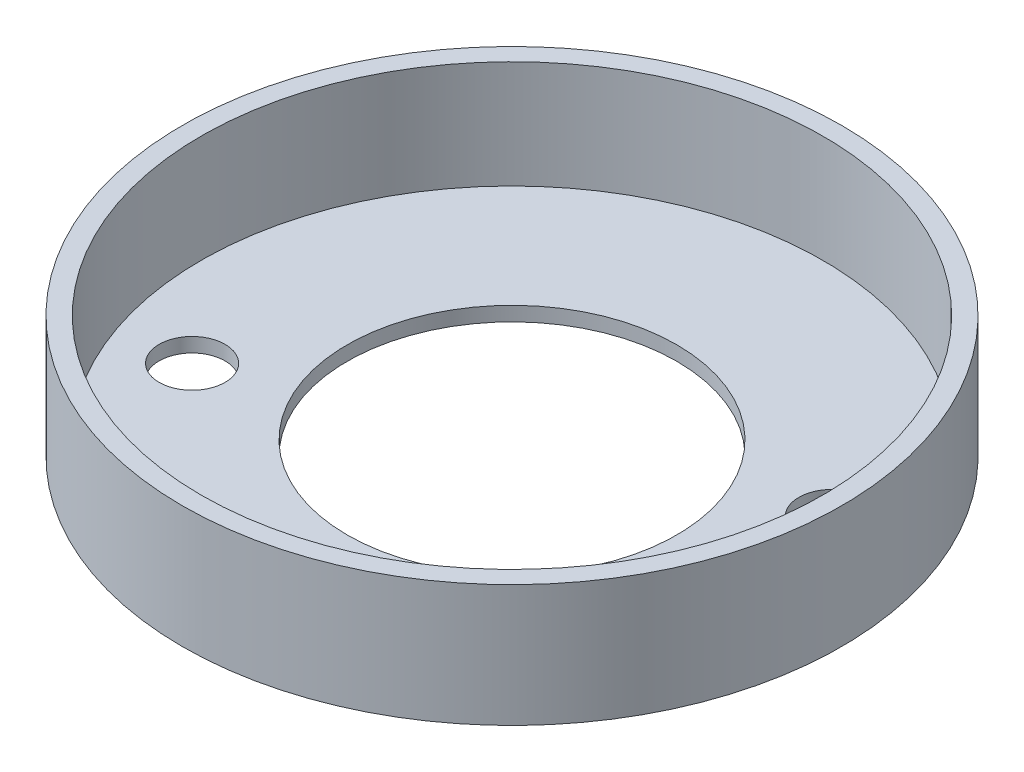
ISO-10303-21;
HEADER;
FILE_DESCRIPTION(('STEP AP214'),'2;1');
FILE_NAME('part.step','',(''),(''),'','','');
FILE_SCHEMA(('AUTOMOTIVE_DESIGN { 1 0 10303 214 1 1 1 1 }'));
ENDSEC;
DATA;
#1=APPLICATION_CONTEXT('core data for automotive mechanical design processes');
#2=APPLICATION_PROTOCOL_DEFINITION('international standard','automotive_design',2000,#1);
#3=PRODUCT_CONTEXT('',#1,'mechanical');
#4=PRODUCT('Part','Part','',(#3));
#5=PRODUCT_RELATED_PRODUCT_CATEGORY('part','',(#4));
#6=PRODUCT_DEFINITION_FORMATION('','',#4);
#7=PRODUCT_DEFINITION_CONTEXT('part definition',#1,'design');
#8=PRODUCT_DEFINITION('design','',#6,#7);
#9=PRODUCT_DEFINITION_SHAPE('','',#8);
#10=(LENGTH_UNIT() NAMED_UNIT(*) SI_UNIT(.MILLI.,.METRE.));
#11=(NAMED_UNIT(*) PLANE_ANGLE_UNIT() SI_UNIT($,.RADIAN.));
#12=(NAMED_UNIT(*) SI_UNIT($,.STERADIAN.) SOLID_ANGLE_UNIT());
#13=UNCERTAINTY_MEASURE_WITH_UNIT(LENGTH_MEASURE(1.E-05),#10,'distance_accuracy_value','');
#14=(GEOMETRIC_REPRESENTATION_CONTEXT(3) GLOBAL_UNCERTAINTY_ASSIGNED_CONTEXT((#13)) GLOBAL_UNIT_ASSIGNED_CONTEXT((#10,
#11,#12)) REPRESENTATION_CONTEXT('',''));
#15=CARTESIAN_POINT('',(0.,0.,0.));
#16=DIRECTION('',(0.,0.,1.));
#17=DIRECTION('',(1.,0.,0.));
#18=AXIS2_PLACEMENT_3D('',#15,#16,#17);
#19=CARTESIAN_POINT('',(0.,12.954,0.));
#20=DIRECTION('',(0.,-1.,0.));
#21=DIRECTION('',(0.,0.,-1.));
#22=AXIS2_PLACEMENT_3D('',#19,#20,#21);
#23=CYLINDRICAL_SURFACE('',#22,17.5);
#24=CARTESIAN_POINT('',(0.,0.,0.));
#25=DIRECTION('',(0.,1.,0.));
#26=DIRECTION('',(0.,0.,1.));
#27=AXIS2_PLACEMENT_3D('',#24,#25,#26);
#28=CIRCLE('',#27,17.5);
#29=CARTESIAN_POINT('',(0.,0.,17.5));
#30=VERTEX_POINT('',#29);
#31=EDGE_CURVE('E46',#30,#30,#28,.T.);
#32=ORIENTED_EDGE('',*,*,#31,.F.);
#33=EDGE_LOOP('',(#32));
#34=FACE_BOUND('',#33,.T.);
#35=CARTESIAN_POINT('',(0.,1.524,0.));
#36=DIRECTION('',(0.,1.,0.));
#37=DIRECTION('',(0.,0.,1.));
#38=AXIS2_PLACEMENT_3D('',#35,#36,#37);
#39=CIRCLE('',#38,17.5);
#40=CARTESIAN_POINT('',(0.,1.524,17.5));
#41=VERTEX_POINT('',#40);
#42=EDGE_CURVE('E59',#41,#41,#39,.T.);
#43=ORIENTED_EDGE('',*,*,#42,.T.);
#44=EDGE_LOOP('',(#43));
#45=FACE_BOUND('',#44,.T.);
#46=ADVANCED_FACE('F33',(#34,#45),#23,.F.);
#47=CARTESIAN_POINT('',(-24.023795501211,12.954,9.95080194897357));
#48=DIRECTION('',(0.,-1.,0.));
#49=DIRECTION('',(0.,0.,-1.));
#50=AXIS2_PLACEMENT_3D('',#47,#48,#49);
#51=CYLINDRICAL_SURFACE('',#50,3.5);
#52=CARTESIAN_POINT('',(-24.023795501211,0.,9.95080194897357));
#53=DIRECTION('',(0.,1.,0.));
#54=DIRECTION('',(0.,0.,1.));
#55=AXIS2_PLACEMENT_3D('',#52,#53,#54);
#56=CIRCLE('',#55,3.5);
#57=CARTESIAN_POINT('',(-24.023795501211,0.,13.4508019489736));
#58=VERTEX_POINT('',#57);
#59=EDGE_CURVE('E50',#58,#58,#56,.T.);
#60=ORIENTED_EDGE('',*,*,#59,.F.);
#61=EDGE_LOOP('',(#60));
#62=FACE_BOUND('',#61,.T.);
#63=CARTESIAN_POINT('',(-24.023795501211,1.524,9.95080194897357));
#64=DIRECTION('',(0.,1.,0.));
#65=DIRECTION('',(0.,0.,1.));
#66=AXIS2_PLACEMENT_3D('',#63,#64,#65);
#67=CIRCLE('',#66,3.5);
#68=CARTESIAN_POINT('',(-24.023795501211,1.524,13.4508019489736));
#69=VERTEX_POINT('',#68);
#70=EDGE_CURVE('E62',#69,#69,#67,.T.);
#71=ORIENTED_EDGE('',*,*,#70,.T.);
#72=EDGE_LOOP('',(#71));
#73=FACE_BOUND('',#72,.T.);
#74=ADVANCED_FACE('F93',(#62,#73),#51,.F.);
#75=CARTESIAN_POINT('',(24.0182399849756,12.954,-9.94801274798736));
#76=DIRECTION('',(0.,-1.,0.));
#77=DIRECTION('',(0.,0.,-1.));
#78=AXIS2_PLACEMENT_3D('',#75,#76,#77);
#79=CYLINDRICAL_SURFACE('',#78,3.5);
#80=CARTESIAN_POINT('',(24.0182399849756,0.,-9.94801274798736));
#81=DIRECTION('',(0.,1.,0.));
#82=DIRECTION('',(0.,0.,1.));
#83=AXIS2_PLACEMENT_3D('',#80,#81,#82);
#84=CIRCLE('',#83,3.5);
#85=CARTESIAN_POINT('',(24.0182399849756,0.,-6.44801274798736));
#86=VERTEX_POINT('',#85);
#87=EDGE_CURVE('E53',#86,#86,#84,.T.);
#88=ORIENTED_EDGE('',*,*,#87,.F.);
#89=EDGE_LOOP('',(#88));
#90=FACE_BOUND('',#89,.T.);
#91=CARTESIAN_POINT('',(24.0182399849756,1.524,-9.94801274798736));
#92=DIRECTION('',(0.,1.,0.));
#93=DIRECTION('',(0.,0.,1.));
#94=AXIS2_PLACEMENT_3D('',#91,#92,#93);
#95=CIRCLE('',#94,3.5);
#96=CARTESIAN_POINT('',(24.0182399849756,1.524,-6.44801274798736));
#97=VERTEX_POINT('',#96);
#98=EDGE_CURVE('E65',#97,#97,#95,.T.);
#99=ORIENTED_EDGE('',*,*,#98,.T.);
#100=EDGE_LOOP('',(#99));
#101=FACE_BOUND('',#100,.T.);
#102=ADVANCED_FACE('F99',(#90,#101),#79,.F.);
#103=CARTESIAN_POINT('',(9.95097452339147,12.954,24.0242121504657));
#104=DIRECTION('',(0.,-1.,0.));
#105=DIRECTION('',(0.,0.,-1.));
#106=AXIS2_PLACEMENT_3D('',#103,#104,#105);
#107=CYLINDRICAL_SURFACE('',#106,3.50000000000001);
#108=CARTESIAN_POINT('',(9.95097452339147,0.,24.0242121504657));
#109=DIRECTION('',(0.,1.,0.));
#110=DIRECTION('',(0.,0.,1.));
#111=AXIS2_PLACEMENT_3D('',#108,#109,#110);
#112=CIRCLE('',#111,3.50000000000001);
#113=CARTESIAN_POINT('',(9.95097452339147,0.,27.5242121504657));
#114=VERTEX_POINT('',#113);
#115=EDGE_CURVE('E56',#114,#114,#112,.T.);
#116=ORIENTED_EDGE('',*,*,#115,.F.);
#117=EDGE_LOOP('',(#116));
#118=FACE_BOUND('',#117,.T.);
#119=CARTESIAN_POINT('',(9.95097452339147,1.524,24.0242121504657));
#120=DIRECTION('',(0.,1.,0.));
#121=DIRECTION('',(0.,0.,1.));
#122=AXIS2_PLACEMENT_3D('',#119,#120,#121);
#123=CIRCLE('',#122,3.50000000000001);
#124=CARTESIAN_POINT('',(9.95097452339147,1.524,27.5242121504657));
#125=VERTEX_POINT('',#124);
#126=EDGE_CURVE('E37',#125,#125,#123,.T.);
#127=ORIENTED_EDGE('',*,*,#126,.T.);
#128=EDGE_LOOP('',(#127));
#129=FACE_BOUND('',#128,.T.);
#130=ADVANCED_FACE('F78',(#118,#129),#107,.F.);
#131=CARTESIAN_POINT('',(0.,12.954,0.));
#132=DIRECTION('',(0.,1.,0.));
#133=DIRECTION('',(0.,0.,1.));
#134=AXIS2_PLACEMENT_3D('',#131,#132,#133);
#135=PLANE('',#134);
#136=CARTESIAN_POINT('',(0.,12.954,0.));
#137=DIRECTION('',(0.,1.,0.));
#138=DIRECTION('',(0.,0.,1.));
#139=AXIS2_PLACEMENT_3D('',#136,#137,#138);
#140=CIRCLE('',#139,33.02);
#141=CARTESIAN_POINT('',(0.,12.954,33.02));
#142=VERTEX_POINT('',#141);
#143=EDGE_CURVE('E68',#142,#142,#140,.T.);
#144=ORIENTED_EDGE('',*,*,#143,.F.);
#145=EDGE_LOOP('',(#144));
#146=FACE_BOUND('',#145,.T.);
#147=CARTESIAN_POINT('',(0.,12.954,0.));
#148=DIRECTION('',(0.,1.,0.));
#149=DIRECTION('',(0.,0.,1.));
#150=AXIS2_PLACEMENT_3D('',#147,#148,#149);
#151=CIRCLE('',#150,35.);
#152=CARTESIAN_POINT('',(0.,12.954,35.));
#153=VERTEX_POINT('',#152);
#154=EDGE_CURVE('E10',#153,#153,#151,.T.);
#155=ORIENTED_EDGE('',*,*,#154,.T.);
#156=EDGE_LOOP('',(#155));
#157=FACE_BOUND('',#156,.T.);
#158=ADVANCED_FACE('F106',(#146,#157),#135,.T.);
#159=CARTESIAN_POINT('',(0.,0.,0.));
#160=DIRECTION('',(0.,1.,0.));
#161=DIRECTION('',(0.,0.,1.));
#162=AXIS2_PLACEMENT_3D('',#159,#160,#161);
#163=PLANE('',#162);
#164=ORIENTED_EDGE('',*,*,#87,.T.);
#165=EDGE_LOOP('',(#164));
#166=FACE_BOUND('',#165,.T.);
#167=ORIENTED_EDGE('',*,*,#31,.T.);
#168=EDGE_LOOP('',(#167));
#169=FACE_BOUND('',#168,.T.);
#170=CARTESIAN_POINT('',(0.,0.,0.));
#171=DIRECTION('',(0.,1.,0.));
#172=DIRECTION('',(0.,0.,1.));
#173=AXIS2_PLACEMENT_3D('',#170,#171,#172);
#174=CIRCLE('',#173,35.);
#175=CARTESIAN_POINT('',(0.,0.,35.));
#176=VERTEX_POINT('',#175);
#177=EDGE_CURVE('E41',#176,#176,#174,.T.);
#178=ORIENTED_EDGE('',*,*,#177,.F.);
#179=EDGE_LOOP('',(#178));
#180=FACE_BOUND('',#179,.T.);
#181=ORIENTED_EDGE('',*,*,#59,.T.);
#182=EDGE_LOOP('',(#181));
#183=FACE_BOUND('',#182,.T.);
#184=ORIENTED_EDGE('',*,*,#115,.T.);
#185=EDGE_LOOP('',(#184));
#186=FACE_BOUND('',#185,.T.);
#187=ADVANCED_FACE('F108',(#166,#169,#180,#183,#186),#163,.F.);
#188=CARTESIAN_POINT('',(0.,12.954,0.));
#189=DIRECTION('',(0.,-1.,0.));
#190=DIRECTION('',(0.,0.,-1.));
#191=AXIS2_PLACEMENT_3D('',#188,#189,#190);
#192=CYLINDRICAL_SURFACE('',#191,35.);
#193=ORIENTED_EDGE('',*,*,#154,.F.);
#194=EDGE_LOOP('',(#193));
#195=FACE_BOUND('',#194,.T.);
#196=ORIENTED_EDGE('',*,*,#177,.T.);
#197=EDGE_LOOP('',(#196));
#198=FACE_BOUND('',#197,.T.);
#199=ADVANCED_FACE('F35',(#195,#198),#192,.T.);
#200=CARTESIAN_POINT('',(0.,1.524,0.));
#201=DIRECTION('',(0.,1.,0.));
#202=DIRECTION('',(0.,0.,1.));
#203=AXIS2_PLACEMENT_3D('',#200,#201,#202);
#204=CYLINDRICAL_SURFACE('',#203,33.02);
#205=CARTESIAN_POINT('',(0.,1.524,0.));
#206=DIRECTION('',(0.,1.,0.));
#207=DIRECTION('',(0.,0.,1.));
#208=AXIS2_PLACEMENT_3D('',#205,#206,#207);
#209=CIRCLE('',#208,33.02);
#210=CARTESIAN_POINT('',(0.,1.524,33.02));
#211=VERTEX_POINT('',#210);
#212=EDGE_CURVE('E71',#211,#211,#209,.T.);
#213=ORIENTED_EDGE('',*,*,#212,.F.);
#214=EDGE_LOOP('',(#213));
#215=FACE_BOUND('',#214,.T.);
#216=ORIENTED_EDGE('',*,*,#143,.T.);
#217=EDGE_LOOP('',(#216));
#218=FACE_BOUND('',#217,.T.);
#219=ADVANCED_FACE('F82',(#215,#218),#204,.F.);
#220=CARTESIAN_POINT('',(0.,1.524,0.));
#221=DIRECTION('',(0.,1.,0.));
#222=DIRECTION('',(0.,0.,1.));
#223=AXIS2_PLACEMENT_3D('',#220,#221,#222);
#224=PLANE('',#223);
#225=ORIENTED_EDGE('',*,*,#42,.F.);
#226=EDGE_LOOP('',(#225));
#227=FACE_BOUND('',#226,.T.);
#228=ORIENTED_EDGE('',*,*,#70,.F.);
#229=EDGE_LOOP('',(#228));
#230=FACE_BOUND('',#229,.T.);
#231=ORIENTED_EDGE('',*,*,#98,.F.);
#232=EDGE_LOOP('',(#231));
#233=FACE_BOUND('',#232,.T.);
#234=ORIENTED_EDGE('',*,*,#126,.F.);
#235=EDGE_LOOP('',(#234));
#236=FACE_BOUND('',#235,.T.);
#237=ORIENTED_EDGE('',*,*,#212,.T.);
#238=EDGE_LOOP('',(#237));
#239=FACE_BOUND('',#238,.T.);
#240=ADVANCED_FACE('F80',(#227,#230,#233,#236,#239),#224,.T.);
#241=CLOSED_SHELL('',(#46,#74,#102,#130,#158,#187,#199,#219,#240));
#242=MANIFOLD_SOLID_BREP('B2',#241);
#243=ADVANCED_BREP_SHAPE_REPRESENTATION('',(#18,#242),#14);
#244=SHAPE_DEFINITION_REPRESENTATION(#9,#243);
ENDSEC;
END-ISO-10303-21;
